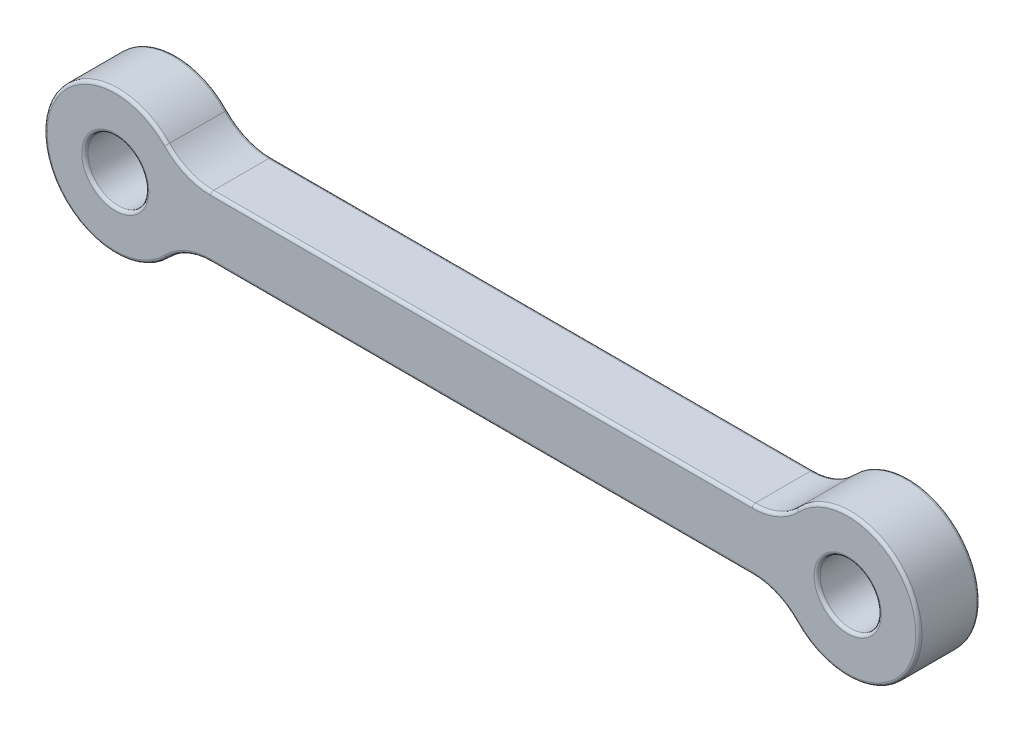
ISO-10303-21;
HEADER;
FILE_DESCRIPTION(('STEP AP214'),'2;1');
FILE_NAME('part.step','',(''),(''),'','','');
FILE_SCHEMA(('AUTOMOTIVE_DESIGN { 1 0 10303 214 1 1 1 1 }'));
ENDSEC;
DATA;
#1=APPLICATION_CONTEXT('core data for automotive mechanical design processes');
#2=APPLICATION_PROTOCOL_DEFINITION('international standard','automotive_design',2000,#1);
#3=PRODUCT_CONTEXT('',#1,'mechanical');
#4=PRODUCT('Part','Part','',(#3));
#5=PRODUCT_RELATED_PRODUCT_CATEGORY('part','',(#4));
#6=PRODUCT_DEFINITION_FORMATION('','',#4);
#7=PRODUCT_DEFINITION_CONTEXT('part definition',#1,'design');
#8=PRODUCT_DEFINITION('design','',#6,#7);
#9=PRODUCT_DEFINITION_SHAPE('','',#8);
#10=(LENGTH_UNIT() NAMED_UNIT(*) SI_UNIT(.MILLI.,.METRE.));
#11=(NAMED_UNIT(*) PLANE_ANGLE_UNIT() SI_UNIT($,.RADIAN.));
#12=(NAMED_UNIT(*) SI_UNIT($,.STERADIAN.) SOLID_ANGLE_UNIT());
#13=UNCERTAINTY_MEASURE_WITH_UNIT(LENGTH_MEASURE(1.E-05),#10,'distance_accuracy_value','');
#14=(GEOMETRIC_REPRESENTATION_CONTEXT(3) GLOBAL_UNCERTAINTY_ASSIGNED_CONTEXT((#13)) GLOBAL_UNIT_ASSIGNED_CONTEXT((#10,
#11,#12)) REPRESENTATION_CONTEXT('',''));
#15=CARTESIAN_POINT('',(0.,0.,0.));
#16=DIRECTION('',(0.,0.,1.));
#17=DIRECTION('',(1.,0.,0.));
#18=AXIS2_PLACEMENT_3D('',#15,#16,#17);
#19=CARTESIAN_POINT('',(0.,1.5,1.5));
#20=DIRECTION('',(0.,1.,0.));
#21=DIRECTION('',(-1.,0.,0.));
#22=AXIS2_PLACEMENT_3D('',#19,#20,#21);
#23=PLANE('',#22);
#24=DIRECTION('',(0.,0.,1.));
#25=VECTOR('',#24,1.);
#26=CARTESIAN_POINT('',(31.3095842401766,1.5,-1.5));
#27=LINE('',#26,#25);
#28=CARTESIAN_POINT('',(31.3095842401766,1.5,1.35));
#29=VERTEX_POINT('',#28);
#30=CARTESIAN_POINT('',(31.3095842401766,1.5,-1.35));
#31=VERTEX_POINT('',#30);
#32=EDGE_CURVE('E380',#29,#31,#27,.F.);
#33=ORIENTED_EDGE('',*,*,#32,.T.);
#34=DIRECTION('',(1.,0.,0.));
#35=VECTOR('',#34,1.);
#36=CARTESIAN_POINT('',(4.69041575982343,1.5,-1.35));
#37=LINE('',#36,#35);
#38=CARTESIAN_POINT('',(4.69041575982343,1.5,-1.35));
#39=VERTEX_POINT('',#38);
#40=EDGE_CURVE('E245',#31,#39,#37,.F.);
#41=ORIENTED_EDGE('',*,*,#40,.T.);
#42=DIRECTION('',(0.,0.,-1.));
#43=VECTOR('',#42,1.);
#44=CARTESIAN_POINT('',(4.69041575982343,1.5,1.5));
#45=LINE('',#44,#43);
#46=CARTESIAN_POINT('',(4.69041575982343,1.5,1.35));
#47=VERTEX_POINT('',#46);
#48=EDGE_CURVE('E376',#39,#47,#45,.F.);
#49=ORIENTED_EDGE('',*,*,#48,.T.);
#50=DIRECTION('',(1.,0.,0.));
#51=VECTOR('',#50,1.);
#52=CARTESIAN_POINT('',(0.,1.5,1.35));
#53=LINE('',#52,#51);
#54=EDGE_CURVE('E242',#47,#29,#53,.T.);
#55=ORIENTED_EDGE('',*,*,#54,.T.);
#56=EDGE_LOOP('',(#33,#41,#49,#55));
#57=FACE_BOUND('',#56,.T.);
#58=ADVANCED_FACE('F45',(#57),#23,.T.);
#59=CARTESIAN_POINT('',(0.,0.,1.5));
#60=DIRECTION('',(0.,0.,-1.));
#61=DIRECTION('',(-1.,0.,0.));
#62=AXIS2_PLACEMENT_3D('',#59,#60,#61);
#63=CYLINDRICAL_SURFACE('',#62,3.5);
#64=DIRECTION('',(0.,0.,-1.));
#65=VECTOR('',#64,1.);
#66=CARTESIAN_POINT('',(2.52560848605877,2.42307692307692,1.5));
#67=LINE('',#66,#65);
#68=CARTESIAN_POINT('',(2.52560848605877,2.42307692307692,1.35));
#69=VERTEX_POINT('',#68);
#70=CARTESIAN_POINT('',(2.52560848605877,2.42307692307692,-1.35));
#71=VERTEX_POINT('',#70);
#72=EDGE_CURVE('E363',#69,#71,#67,.T.);
#73=ORIENTED_EDGE('',*,*,#72,.T.);
#74=CARTESIAN_POINT('',(0.,0.,-1.35));
#75=DIRECTION('',(0.,0.,1.));
#76=DIRECTION('',(1.,0.,0.));
#77=AXIS2_PLACEMENT_3D('',#74,#75,#76);
#78=CIRCLE('',#77,3.5);
#79=CARTESIAN_POINT('',(2.52560848605877,-2.42307692307692,-1.35));
#80=VERTEX_POINT('',#79);
#81=EDGE_CURVE('E257',#71,#80,#78,.T.);
#82=ORIENTED_EDGE('',*,*,#81,.T.);
#83=DIRECTION('',(0.,0.,-1.));
#84=VECTOR('',#83,1.);
#85=CARTESIAN_POINT('',(2.52560848605877,-2.42307692307692,1.5));
#86=LINE('',#85,#84);
#87=CARTESIAN_POINT('',(2.52560848605877,-2.42307692307692,1.35));
#88=VERTEX_POINT('',#87);
#89=EDGE_CURVE('E354',#80,#88,#86,.F.);
#90=ORIENTED_EDGE('',*,*,#89,.T.);
#91=CARTESIAN_POINT('',(0.,0.,1.35));
#92=DIRECTION('',(0.,0.,1.));
#93=DIRECTION('',(1.,0.,0.));
#94=AXIS2_PLACEMENT_3D('',#91,#92,#93);
#95=CIRCLE('',#94,3.5);
#96=EDGE_CURVE('E254',#88,#69,#95,.F.);
#97=ORIENTED_EDGE('',*,*,#96,.T.);
#98=EDGE_LOOP('',(#73,#82,#90,#97));
#99=FACE_BOUND('',#98,.T.);
#100=ADVANCED_FACE('F359',(#99),#63,.T.);
#101=CARTESIAN_POINT('',(0.,-1.5,1.5));
#102=DIRECTION('',(0.,1.,0.));
#103=DIRECTION('',(-1.,0.,0.));
#104=AXIS2_PLACEMENT_3D('',#101,#102,#103);
#105=PLANE('',#104);
#106=DIRECTION('',(0.,0.,1.));
#107=VECTOR('',#106,1.);
#108=CARTESIAN_POINT('',(4.69041575982343,-1.5,-1.5));
#109=LINE('',#108,#107);
#110=CARTESIAN_POINT('',(4.69041575982343,-1.5,1.35));
#111=VERTEX_POINT('',#110);
#112=CARTESIAN_POINT('',(4.69041575982343,-1.5,-1.35));
#113=VERTEX_POINT('',#112);
#114=EDGE_CURVE('E356',#111,#113,#109,.F.);
#115=ORIENTED_EDGE('',*,*,#114,.T.);
#116=DIRECTION('',(1.,0.,0.));
#117=VECTOR('',#116,1.);
#118=CARTESIAN_POINT('',(0.,-1.5,-1.35));
#119=LINE('',#118,#117);
#120=CARTESIAN_POINT('',(31.3095842401766,-1.5,-1.35));
#121=VERTEX_POINT('',#120);
#122=EDGE_CURVE('E220',#113,#121,#119,.T.);
#123=ORIENTED_EDGE('',*,*,#122,.T.);
#124=DIRECTION('',(0.,0.,-1.));
#125=VECTOR('',#124,1.);
#126=CARTESIAN_POINT('',(31.3095842401766,-1.5,1.5));
#127=LINE('',#126,#125);
#128=CARTESIAN_POINT('',(31.3095842401766,-1.5,1.35));
#129=VERTEX_POINT('',#128);
#130=EDGE_CURVE('E309',#121,#129,#127,.F.);
#131=ORIENTED_EDGE('',*,*,#130,.T.);
#132=DIRECTION('',(1.,0.,0.));
#133=VECTOR('',#132,1.);
#134=CARTESIAN_POINT('',(4.69041575982343,-1.5,1.35));
#135=LINE('',#134,#133);
#136=EDGE_CURVE('E217',#129,#111,#135,.F.);
#137=ORIENTED_EDGE('',*,*,#136,.T.);
#138=EDGE_LOOP('',(#115,#123,#131,#137));
#139=FACE_BOUND('',#138,.T.);
#140=ADVANCED_FACE('F415',(#139),#105,.F.);
#141=CARTESIAN_POINT('',(0.,0.,1.5));
#142=DIRECTION('',(0.,0.,-1.));
#143=DIRECTION('',(-1.,0.,0.));
#144=AXIS2_PLACEMENT_3D('',#141,#142,#143);
#145=CYLINDRICAL_SURFACE('',#144,1.5);
#146=CARTESIAN_POINT('',(0.,0.,-1.35));
#147=DIRECTION('',(0.,0.,1.));
#148=DIRECTION('',(1.,0.,0.));
#149=AXIS2_PLACEMENT_3D('',#146,#147,#148);
#150=CIRCLE('',#149,1.5);
#151=CARTESIAN_POINT('',(1.5,0.,-1.35));
#152=VERTEX_POINT('',#151);
#153=EDGE_CURVE('E208',#152,#152,#150,.F.);
#154=ORIENTED_EDGE('',*,*,#153,.T.);
#155=EDGE_LOOP('',(#154));
#156=FACE_BOUND('',#155,.T.);
#157=CARTESIAN_POINT('',(0.,0.,1.35));
#158=DIRECTION('',(0.,0.,1.));
#159=DIRECTION('',(1.,0.,0.));
#160=AXIS2_PLACEMENT_3D('',#157,#158,#159);
#161=CIRCLE('',#160,1.5);
#162=CARTESIAN_POINT('',(1.5,0.,1.35));
#163=VERTEX_POINT('',#162);
#164=EDGE_CURVE('E204',#163,#163,#161,.T.);
#165=ORIENTED_EDGE('',*,*,#164,.T.);
#166=EDGE_LOOP('',(#165));
#167=FACE_BOUND('',#166,.T.);
#168=ADVANCED_FACE('F464',(#156,#167),#145,.F.);
#169=CARTESIAN_POINT('',(36.,0.,1.5));
#170=DIRECTION('',(0.,0.,-1.));
#171=DIRECTION('',(-1.,0.,0.));
#172=AXIS2_PLACEMENT_3D('',#169,#170,#171);
#173=CYLINDRICAL_SURFACE('',#172,3.5);
#174=DIRECTION('',(0.,0.,-1.));
#175=VECTOR('',#174,1.);
#176=CARTESIAN_POINT('',(33.4743915139412,-2.42307692307692,1.5));
#177=LINE('',#176,#175);
#178=CARTESIAN_POINT('',(33.4743915139412,-2.42307692307692,1.35));
#179=VERTEX_POINT('',#178);
#180=CARTESIAN_POINT('',(33.4743915139412,-2.42307692307692,-1.35));
#181=VERTEX_POINT('',#180);
#182=EDGE_CURVE('E368',#179,#181,#177,.T.);
#183=ORIENTED_EDGE('',*,*,#182,.T.);
#184=CARTESIAN_POINT('',(36.,0.,-1.35));
#185=DIRECTION('',(0.,0.,1.));
#186=DIRECTION('',(1.,0.,0.));
#187=AXIS2_PLACEMENT_3D('',#184,#185,#186);
#188=CIRCLE('',#187,3.5);
#189=CARTESIAN_POINT('',(33.4743915139412,2.42307692307692,-1.35));
#190=VERTEX_POINT('',#189);
#191=EDGE_CURVE('E232',#181,#190,#188,.T.);
#192=ORIENTED_EDGE('',*,*,#191,.T.);
#193=DIRECTION('',(0.,0.,-1.));
#194=VECTOR('',#193,1.);
#195=CARTESIAN_POINT('',(33.4743915139412,2.42307692307692,1.5));
#196=LINE('',#195,#194);
#197=CARTESIAN_POINT('',(33.4743915139412,2.42307692307692,1.35));
#198=VERTEX_POINT('',#197);
#199=EDGE_CURVE('E362',#190,#198,#196,.F.);
#200=ORIENTED_EDGE('',*,*,#199,.T.);
#201=CARTESIAN_POINT('',(36.,0.,1.35));
#202=DIRECTION('',(0.,0.,1.));
#203=DIRECTION('',(1.,0.,0.));
#204=AXIS2_PLACEMENT_3D('',#201,#202,#203);
#205=CIRCLE('',#204,3.5);
#206=EDGE_CURVE('E229',#198,#179,#205,.F.);
#207=ORIENTED_EDGE('',*,*,#206,.T.);
#208=EDGE_LOOP('',(#183,#192,#200,#207));
#209=FACE_BOUND('',#208,.T.);
#210=ADVANCED_FACE('F461',(#209),#173,.T.);
#211=CARTESIAN_POINT('',(36.,0.,1.5));
#212=DIRECTION('',(0.,0.,-1.));
#213=DIRECTION('',(-1.,0.,0.));
#214=AXIS2_PLACEMENT_3D('',#211,#212,#213);
#215=CYLINDRICAL_SURFACE('',#214,1.5);
#216=CARTESIAN_POINT('',(36.,0.,-1.35));
#217=DIRECTION('',(0.,0.,1.));
#218=DIRECTION('',(1.,0.,0.));
#219=AXIS2_PLACEMENT_3D('',#216,#217,#218);
#220=CIRCLE('',#219,1.5);
#221=CARTESIAN_POINT('',(37.5,0.,-1.35));
#222=VERTEX_POINT('',#221);
#223=EDGE_CURVE('E183',#222,#222,#220,.F.);
#224=ORIENTED_EDGE('',*,*,#223,.T.);
#225=EDGE_LOOP('',(#224));
#226=FACE_BOUND('',#225,.T.);
#227=CARTESIAN_POINT('',(36.,0.,1.35));
#228=DIRECTION('',(0.,0.,1.));
#229=DIRECTION('',(1.,0.,0.));
#230=AXIS2_PLACEMENT_3D('',#227,#228,#229);
#231=CIRCLE('',#230,1.5);
#232=CARTESIAN_POINT('',(37.5,0.,1.35));
#233=VERTEX_POINT('',#232);
#234=EDGE_CURVE('E384',#233,#233,#231,.T.);
#235=ORIENTED_EDGE('',*,*,#234,.T.);
#236=EDGE_LOOP('',(#235));
#237=FACE_BOUND('',#236,.T.);
#238=ADVANCED_FACE('F463',(#226,#237),#215,.F.);
#239=CARTESIAN_POINT('',(0.,0.,1.5));
#240=DIRECTION('',(0.,0.,1.));
#241=DIRECTION('',(1.,0.,0.));
#242=AXIS2_PLACEMENT_3D('',#239,#240,#241);
#243=PLANE('',#242);
#244=CARTESIAN_POINT('',(36.,0.,1.5));
#245=DIRECTION('',(0.,0.,1.));
#246=DIRECTION('',(1.,0.,0.));
#247=AXIS2_PLACEMENT_3D('',#244,#245,#246);
#248=CIRCLE('',#247,1.65);
#249=CARTESIAN_POINT('',(37.65,0.,1.5));
#250=VERTEX_POINT('',#249);
#251=EDGE_CURVE('E11',#250,#250,#248,.F.);
#252=ORIENTED_EDGE('',*,*,#251,.T.);
#253=EDGE_LOOP('',(#252));
#254=FACE_BOUND('',#253,.T.);
#255=CARTESIAN_POINT('',(0.,0.,1.5));
#256=DIRECTION('',(0.,0.,1.));
#257=DIRECTION('',(1.,0.,0.));
#258=AXIS2_PLACEMENT_3D('',#255,#256,#257);
#259=CIRCLE('',#258,1.65);
#260=CARTESIAN_POINT('',(1.65,0.,1.5));
#261=VERTEX_POINT('',#260);
#262=EDGE_CURVE('E55',#261,#261,#259,.F.);
#263=ORIENTED_EDGE('',*,*,#262,.T.);
#264=EDGE_LOOP('',(#263));
#265=FACE_BOUND('',#264,.T.);
#266=CARTESIAN_POINT('',(36.,0.,1.5));
#267=DIRECTION('',(0.,0.,1.));
#268=DIRECTION('',(1.,0.,0.));
#269=AXIS2_PLACEMENT_3D('',#266,#267,#268);
#270=CIRCLE('',#269,3.35);
#271=CARTESIAN_POINT('',(33.5826318776295,-2.31923076923077,1.5));
#272=VERTEX_POINT('',#271);
#273=CARTESIAN_POINT('',(33.5826318776295,2.31923076923077,1.5));
#274=VERTEX_POINT('',#273);
#275=EDGE_CURVE('E63',#272,#274,#270,.T.);
#276=ORIENTED_EDGE('',*,*,#275,.T.);
#277=CARTESIAN_POINT('',(31.3095842401766,4.5,1.5));
#278=DIRECTION('',(0.,0.,1.));
#279=DIRECTION('',(1.,0.,0.));
#280=AXIS2_PLACEMENT_3D('',#277,#278,#279);
#281=CIRCLE('',#280,3.15);
#282=CARTESIAN_POINT('',(31.3095842401766,1.35,1.5));
#283=VERTEX_POINT('',#282);
#284=EDGE_CURVE('E279',#274,#283,#281,.F.);
#285=ORIENTED_EDGE('',*,*,#284,.T.);
#286=DIRECTION('',(1.,0.,0.));
#287=VECTOR('',#286,1.);
#288=CARTESIAN_POINT('',(0.,1.35,1.5));
#289=LINE('',#288,#287);
#290=CARTESIAN_POINT('',(4.69041575982343,1.35,1.5));
#291=VERTEX_POINT('',#290);
#292=EDGE_CURVE('E260',#283,#291,#289,.F.);
#293=ORIENTED_EDGE('',*,*,#292,.T.);
#294=CARTESIAN_POINT('',(4.69041575982343,4.5,1.5));
#295=DIRECTION('',(0.,0.,1.));
#296=DIRECTION('',(1.,0.,0.));
#297=AXIS2_PLACEMENT_3D('',#294,#295,#296);
#298=CIRCLE('',#297,3.15);
#299=CARTESIAN_POINT('',(2.41736812237054,2.31923076923077,1.5));
#300=VERTEX_POINT('',#299);
#301=EDGE_CURVE('E263',#291,#300,#298,.F.);
#302=ORIENTED_EDGE('',*,*,#301,.T.);
#303=CARTESIAN_POINT('',(0.,0.,1.5));
#304=DIRECTION('',(0.,0.,1.));
#305=DIRECTION('',(1.,0.,0.));
#306=AXIS2_PLACEMENT_3D('',#303,#304,#305);
#307=CIRCLE('',#306,3.35);
#308=CARTESIAN_POINT('',(2.41736812237054,-2.31923076923077,1.5));
#309=VERTEX_POINT('',#308);
#310=EDGE_CURVE('E266',#300,#309,#307,.T.);
#311=ORIENTED_EDGE('',*,*,#310,.T.);
#312=CARTESIAN_POINT('',(4.69041575982343,-4.5,1.5));
#313=DIRECTION('',(0.,0.,1.));
#314=DIRECTION('',(1.,0.,0.));
#315=AXIS2_PLACEMENT_3D('',#312,#313,#314);
#316=CIRCLE('',#315,3.15);
#317=CARTESIAN_POINT('',(4.69041575982343,-1.35,1.5));
#318=VERTEX_POINT('',#317);
#319=EDGE_CURVE('E269',#309,#318,#316,.F.);
#320=ORIENTED_EDGE('',*,*,#319,.T.);
#321=DIRECTION('',(1.,0.,0.));
#322=VECTOR('',#321,1.);
#323=CARTESIAN_POINT('',(31.3095842401766,-1.35,1.5));
#324=LINE('',#323,#322);
#325=CARTESIAN_POINT('',(31.3095842401766,-1.35,1.5));
#326=VERTEX_POINT('',#325);
#327=EDGE_CURVE('E272',#318,#326,#324,.T.);
#328=ORIENTED_EDGE('',*,*,#327,.T.);
#329=CARTESIAN_POINT('',(31.3095842401766,-4.5,1.5));
#330=DIRECTION('',(0.,0.,1.));
#331=DIRECTION('',(1.,0.,0.));
#332=AXIS2_PLACEMENT_3D('',#329,#330,#331);
#333=CIRCLE('',#332,3.15);
#334=EDGE_CURVE('E68',#326,#272,#333,.F.);
#335=ORIENTED_EDGE('',*,*,#334,.T.);
#336=EDGE_LOOP('',(#276,#285,#293,#302,#311,#320,#328,#335));
#337=FACE_BOUND('',#336,.T.);
#338=ADVANCED_FACE('F434',(#254,#265,#337),#243,.T.);
#339=CARTESIAN_POINT('',(0.,0.,-1.5));
#340=DIRECTION('',(0.,0.,1.));
#341=DIRECTION('',(1.,0.,0.));
#342=AXIS2_PLACEMENT_3D('',#339,#340,#341);
#343=PLANE('',#342);
#344=CARTESIAN_POINT('',(36.,0.,-1.5));
#345=DIRECTION('',(0.,0.,1.));
#346=DIRECTION('',(1.,0.,0.));
#347=AXIS2_PLACEMENT_3D('',#344,#345,#346);
#348=CIRCLE('',#347,1.65);
#349=CARTESIAN_POINT('',(37.65,0.,-1.5));
#350=VERTEX_POINT('',#349);
#351=EDGE_CURVE('E195',#350,#350,#348,.T.);
#352=ORIENTED_EDGE('',*,*,#351,.T.);
#353=EDGE_LOOP('',(#352));
#354=FACE_BOUND('',#353,.T.);
#355=CARTESIAN_POINT('',(0.,0.,-1.5));
#356=DIRECTION('',(0.,0.,1.));
#357=DIRECTION('',(1.,0.,0.));
#358=AXIS2_PLACEMENT_3D('',#355,#356,#357);
#359=CIRCLE('',#358,1.65);
#360=CARTESIAN_POINT('',(1.65,0.,-1.5));
#361=VERTEX_POINT('',#360);
#362=EDGE_CURVE('E190',#361,#361,#359,.T.);
#363=ORIENTED_EDGE('',*,*,#362,.T.);
#364=EDGE_LOOP('',(#363));
#365=FACE_BOUND('',#364,.T.);
#366=DIRECTION('',(1.,0.,0.));
#367=VECTOR('',#366,1.);
#368=CARTESIAN_POINT('',(0.,-1.35,-1.5));
#369=LINE('',#368,#367);
#370=CARTESIAN_POINT('',(31.3095842401766,-1.35,-1.5));
#371=VERTEX_POINT('',#370);
#372=CARTESIAN_POINT('',(4.69041575982343,-1.35,-1.5));
#373=VERTEX_POINT('',#372);
#374=EDGE_CURVE('E187',#371,#373,#369,.F.);
#375=ORIENTED_EDGE('',*,*,#374,.T.);
#376=CARTESIAN_POINT('',(4.69041575982343,-4.5,-1.5));
#377=DIRECTION('',(0.,0.,1.));
#378=DIRECTION('',(1.,0.,0.));
#379=AXIS2_PLACEMENT_3D('',#376,#377,#378);
#380=CIRCLE('',#379,3.15);
#381=CARTESIAN_POINT('',(2.41736812237054,-2.31923076923077,-1.5));
#382=VERTEX_POINT('',#381);
#383=EDGE_CURVE('E166',#373,#382,#380,.T.);
#384=ORIENTED_EDGE('',*,*,#383,.T.);
#385=CARTESIAN_POINT('',(0.,0.,-1.5));
#386=DIRECTION('',(0.,0.,1.));
#387=DIRECTION('',(1.,0.,0.));
#388=AXIS2_PLACEMENT_3D('',#385,#386,#387);
#389=CIRCLE('',#388,3.35);
#390=CARTESIAN_POINT('',(2.41736812237054,2.31923076923077,-1.5));
#391=VERTEX_POINT('',#390);
#392=EDGE_CURVE('E175',#382,#391,#389,.F.);
#393=ORIENTED_EDGE('',*,*,#392,.T.);
#394=CARTESIAN_POINT('',(4.69041575982343,4.5,-1.5));
#395=DIRECTION('',(0.,0.,1.));
#396=DIRECTION('',(1.,0.,0.));
#397=AXIS2_PLACEMENT_3D('',#394,#395,#396);
#398=CIRCLE('',#397,3.15);
#399=CARTESIAN_POINT('',(4.69041575982343,1.35,-1.5));
#400=VERTEX_POINT('',#399);
#401=EDGE_CURVE('E182',#391,#400,#398,.T.);
#402=ORIENTED_EDGE('',*,*,#401,.T.);
#403=DIRECTION('',(1.,0.,0.));
#404=VECTOR('',#403,1.);
#405=CARTESIAN_POINT('',(31.3095842401766,1.35,-1.5));
#406=LINE('',#405,#404);
#407=CARTESIAN_POINT('',(31.3095842401766,1.35,-1.5));
#408=VERTEX_POINT('',#407);
#409=EDGE_CURVE('E393',#400,#408,#406,.T.);
#410=ORIENTED_EDGE('',*,*,#409,.T.);
#411=CARTESIAN_POINT('',(31.3095842401766,4.5,-1.5));
#412=DIRECTION('',(0.,0.,1.));
#413=DIRECTION('',(1.,0.,0.));
#414=AXIS2_PLACEMENT_3D('',#411,#412,#413);
#415=CIRCLE('',#414,3.15);
#416=CARTESIAN_POINT('',(33.5826318776295,2.31923076923077,-1.5));
#417=VERTEX_POINT('',#416);
#418=EDGE_CURVE('E396',#408,#417,#415,.T.);
#419=ORIENTED_EDGE('',*,*,#418,.T.);
#420=CARTESIAN_POINT('',(36.,0.,-1.5));
#421=DIRECTION('',(0.,0.,1.));
#422=DIRECTION('',(1.,0.,0.));
#423=AXIS2_PLACEMENT_3D('',#420,#421,#422);
#424=CIRCLE('',#423,3.35);
#425=CARTESIAN_POINT('',(33.5826318776295,-2.31923076923077,-1.5));
#426=VERTEX_POINT('',#425);
#427=EDGE_CURVE('E399',#417,#426,#424,.F.);
#428=ORIENTED_EDGE('',*,*,#427,.T.);
#429=CARTESIAN_POINT('',(31.3095842401766,-4.5,-1.5));
#430=DIRECTION('',(0.,0.,1.));
#431=DIRECTION('',(1.,0.,0.));
#432=AXIS2_PLACEMENT_3D('',#429,#430,#431);
#433=CIRCLE('',#432,3.15);
#434=EDGE_CURVE('E197',#426,#371,#433,.T.);
#435=ORIENTED_EDGE('',*,*,#434,.T.);
#436=EDGE_LOOP('',(#375,#384,#393,#402,#410,#419,#428,#435));
#437=FACE_BOUND('',#436,.T.);
#438=ADVANCED_FACE('F185',(#354,#365,#437),#343,.F.);
#439=CARTESIAN_POINT('',(4.69041575982343,-4.5,1.5));
#440=DIRECTION('',(0.,0.,-1.));
#441=DIRECTION('',(-1.,0.,0.));
#442=AXIS2_PLACEMENT_3D('',#439,#440,#441);
#443=CYLINDRICAL_SURFACE('',#442,3.);
#444=ORIENTED_EDGE('',*,*,#89,.F.);
#445=CARTESIAN_POINT('',(4.69041575982343,-4.5,-1.35));
#446=DIRECTION('',(0.,0.,1.));
#447=DIRECTION('',(1.,0.,0.));
#448=AXIS2_PLACEMENT_3D('',#445,#446,#447);
#449=CIRCLE('',#448,3.);
#450=EDGE_CURVE('E168',#80,#113,#449,.F.);
#451=ORIENTED_EDGE('',*,*,#450,.T.);
#452=ORIENTED_EDGE('',*,*,#114,.F.);
#453=CARTESIAN_POINT('',(4.69041575982343,-4.5,1.35));
#454=DIRECTION('',(0.,0.,1.));
#455=DIRECTION('',(1.,0.,0.));
#456=AXIS2_PLACEMENT_3D('',#453,#454,#455);
#457=CIRCLE('',#456,3.);
#458=EDGE_CURVE('E212',#111,#88,#457,.T.);
#459=ORIENTED_EDGE('',*,*,#458,.T.);
#460=EDGE_LOOP('',(#444,#451,#452,#459));
#461=FACE_BOUND('',#460,.T.);
#462=ADVANCED_FACE('F353',(#461),#443,.F.);
#463=CARTESIAN_POINT('',(31.3095842401766,-4.5,1.5));
#464=DIRECTION('',(0.,0.,-1.));
#465=DIRECTION('',(-1.,0.,0.));
#466=AXIS2_PLACEMENT_3D('',#463,#464,#465);
#467=CYLINDRICAL_SURFACE('',#466,3.);
#468=ORIENTED_EDGE('',*,*,#130,.F.);
#469=CARTESIAN_POINT('',(31.3095842401766,-4.5,-1.35));
#470=DIRECTION('',(0.,0.,1.));
#471=DIRECTION('',(1.,0.,0.));
#472=AXIS2_PLACEMENT_3D('',#469,#470,#471);
#473=CIRCLE('',#472,3.);
#474=EDGE_CURVE('E226',#121,#181,#473,.F.);
#475=ORIENTED_EDGE('',*,*,#474,.T.);
#476=ORIENTED_EDGE('',*,*,#182,.F.);
#477=CARTESIAN_POINT('',(31.3095842401766,-4.5,1.35));
#478=DIRECTION('',(0.,0.,1.));
#479=DIRECTION('',(1.,0.,0.));
#480=AXIS2_PLACEMENT_3D('',#477,#478,#479);
#481=CIRCLE('',#480,3.);
#482=EDGE_CURVE('E223',#179,#129,#481,.T.);
#483=ORIENTED_EDGE('',*,*,#482,.T.);
#484=EDGE_LOOP('',(#468,#475,#476,#483));
#485=FACE_BOUND('',#484,.T.);
#486=ADVANCED_FACE('F420',(#485),#467,.F.);
#487=CARTESIAN_POINT('',(31.3095842401766,4.5,1.5));
#488=DIRECTION('',(0.,0.,-1.));
#489=DIRECTION('',(-1.,0.,0.));
#490=AXIS2_PLACEMENT_3D('',#487,#488,#489);
#491=CYLINDRICAL_SURFACE('',#490,3.);
#492=ORIENTED_EDGE('',*,*,#199,.F.);
#493=CARTESIAN_POINT('',(31.3095842401766,4.5,-1.35));
#494=DIRECTION('',(0.,0.,1.));
#495=DIRECTION('',(1.,0.,0.));
#496=AXIS2_PLACEMENT_3D('',#493,#494,#495);
#497=CIRCLE('',#496,3.);
#498=EDGE_CURVE('E239',#190,#31,#497,.F.);
#499=ORIENTED_EDGE('',*,*,#498,.T.);
#500=ORIENTED_EDGE('',*,*,#32,.F.);
#501=CARTESIAN_POINT('',(31.3095842401766,4.5,1.35));
#502=DIRECTION('',(0.,0.,1.));
#503=DIRECTION('',(1.,0.,0.));
#504=AXIS2_PLACEMENT_3D('',#501,#502,#503);
#505=CIRCLE('',#504,3.);
#506=EDGE_CURVE('E235',#29,#198,#505,.T.);
#507=ORIENTED_EDGE('',*,*,#506,.T.);
#508=EDGE_LOOP('',(#492,#499,#500,#507));
#509=FACE_BOUND('',#508,.T.);
#510=ADVANCED_FACE('F450',(#509),#491,.F.);
#511=CARTESIAN_POINT('',(4.69041575982343,4.5,1.5));
#512=DIRECTION('',(0.,0.,-1.));
#513=DIRECTION('',(-1.,0.,0.));
#514=AXIS2_PLACEMENT_3D('',#511,#512,#513);
#515=CYLINDRICAL_SURFACE('',#514,3.);
#516=ORIENTED_EDGE('',*,*,#48,.F.);
#517=CARTESIAN_POINT('',(4.69041575982343,4.5,-1.35));
#518=DIRECTION('',(0.,0.,1.));
#519=DIRECTION('',(1.,0.,0.));
#520=AXIS2_PLACEMENT_3D('',#517,#518,#519);
#521=CIRCLE('',#520,3.);
#522=EDGE_CURVE('E251',#39,#71,#521,.F.);
#523=ORIENTED_EDGE('',*,*,#522,.T.);
#524=ORIENTED_EDGE('',*,*,#72,.F.);
#525=CARTESIAN_POINT('',(4.69041575982343,4.5,1.35));
#526=DIRECTION('',(0.,0.,1.));
#527=DIRECTION('',(1.,0.,0.));
#528=AXIS2_PLACEMENT_3D('',#525,#526,#527);
#529=CIRCLE('',#528,3.);
#530=EDGE_CURVE('E248',#69,#47,#529,.T.);
#531=ORIENTED_EDGE('',*,*,#530,.T.);
#532=EDGE_LOOP('',(#516,#523,#524,#531));
#533=FACE_BOUND('',#532,.T.);
#534=ADVANCED_FACE('F488',(#533),#515,.F.);
#535=CARTESIAN_POINT('',(36.,0.,-1.35));
#536=DIRECTION('',(0.,0.,1.));
#537=DIRECTION('',(1.,0.,0.));
#538=AXIS2_PLACEMENT_3D('',#535,#536,#537);
#539=TOROIDAL_SURFACE('',#538,1.65,0.15);
#540=ORIENTED_EDGE('',*,*,#351,.F.);
#541=EDGE_LOOP('',(#540));
#542=FACE_BOUND('',#541,.T.);
#543=ORIENTED_EDGE('',*,*,#223,.F.);
#544=EDGE_LOOP('',(#543));
#545=FACE_BOUND('',#544,.T.);
#546=ADVANCED_FACE('F491',(#542,#545),#539,.T.);
#547=CARTESIAN_POINT('',(0.,0.,-1.35));
#548=DIRECTION('',(0.,0.,1.));
#549=DIRECTION('',(1.,0.,0.));
#550=AXIS2_PLACEMENT_3D('',#547,#548,#549);
#551=TOROIDAL_SURFACE('',#550,1.65,0.15);
#552=ORIENTED_EDGE('',*,*,#153,.F.);
#553=EDGE_LOOP('',(#552));
#554=FACE_BOUND('',#553,.T.);
#555=ORIENTED_EDGE('',*,*,#362,.F.);
#556=EDGE_LOOP('',(#555));
#557=FACE_BOUND('',#556,.T.);
#558=ADVANCED_FACE('F495',(#554,#557),#551,.T.);
#559=CARTESIAN_POINT('',(31.3095842401766,4.5,-1.35));
#560=DIRECTION('',(0.,0.,1.));
#561=DIRECTION('',(1.,0.,0.));
#562=AXIS2_PLACEMENT_3D('',#559,#560,#561);
#563=TOROIDAL_SURFACE('',#562,3.15,0.15);
#564=CARTESIAN_POINT('',(31.3095842401766,1.35,-1.35));
#565=DIRECTION('',(-1.,0.,0.));
#566=DIRECTION('',(0.,0.,1.));
#567=AXIS2_PLACEMENT_3D('',#564,#565,#566);
#568=CIRCLE('',#567,0.15);
#569=EDGE_CURVE('E301',#31,#408,#568,.T.);
#570=ORIENTED_EDGE('',*,*,#569,.F.);
#571=ORIENTED_EDGE('',*,*,#498,.F.);
#572=CARTESIAN_POINT('',(33.5826318776295,2.31923076923077,-1.35));
#573=DIRECTION('',(0.692307692307681,0.721602424588231,0.));
#574=DIRECTION('',(-0.721602424588231,0.692307692307681,0.));
#575=AXIS2_PLACEMENT_3D('',#572,#573,#574);
#576=CIRCLE('',#575,0.15);
#577=EDGE_CURVE('E305',#417,#190,#576,.T.);
#578=ORIENTED_EDGE('',*,*,#577,.F.);
#579=ORIENTED_EDGE('',*,*,#418,.F.);
#580=EDGE_LOOP('',(#570,#571,#578,#579));
#581=FACE_BOUND('',#580,.T.);
#582=ADVANCED_FACE('F454',(#581),#563,.T.);
#583=CARTESIAN_POINT('',(36.,0.,-1.35));
#584=DIRECTION('',(0.,0.,1.));
#585=DIRECTION('',(1.,0.,0.));
#586=AXIS2_PLACEMENT_3D('',#583,#584,#585);
#587=TOROIDAL_SURFACE('',#586,3.35,0.15);
#588=ORIENTED_EDGE('',*,*,#577,.T.);
#589=ORIENTED_EDGE('',*,*,#191,.F.);
#590=CARTESIAN_POINT('',(33.5826318776295,-2.31923076923077,-1.35));
#591=DIRECTION('',(-0.692307692307679,0.721602424588232,0.));
#592=DIRECTION('',(-0.721602424588232,-0.692307692307679,0.));
#593=AXIS2_PLACEMENT_3D('',#590,#591,#592);
#594=CIRCLE('',#593,0.15);
#595=EDGE_CURVE('E297',#426,#181,#594,.T.);
#596=ORIENTED_EDGE('',*,*,#595,.F.);
#597=ORIENTED_EDGE('',*,*,#427,.F.);
#598=EDGE_LOOP('',(#588,#589,#596,#597));
#599=FACE_BOUND('',#598,.T.);
#600=ADVANCED_FACE('F459',(#599),#587,.T.);
#601=CARTESIAN_POINT('',(0.,1.35,-1.35));
#602=DIRECTION('',(-1.,0.,0.));
#603=DIRECTION('',(0.,-1.,0.));
#604=AXIS2_PLACEMENT_3D('',#601,#602,#603);
#605=CYLINDRICAL_SURFACE('',#604,0.15);
#606=ORIENTED_EDGE('',*,*,#569,.T.);
#607=ORIENTED_EDGE('',*,*,#409,.F.);
#608=CARTESIAN_POINT('',(4.69041575982343,1.35,-1.35));
#609=DIRECTION('',(-1.,0.,0.));
#610=DIRECTION('',(0.,0.,1.));
#611=AXIS2_PLACEMENT_3D('',#608,#609,#610);
#612=CIRCLE('',#611,0.15);
#613=EDGE_CURVE('E293',#39,#400,#612,.T.);
#614=ORIENTED_EDGE('',*,*,#613,.F.);
#615=ORIENTED_EDGE('',*,*,#40,.F.);
#616=EDGE_LOOP('',(#606,#607,#614,#615));
#617=FACE_BOUND('',#616,.T.);
#618=ADVANCED_FACE('F513',(#617),#605,.T.);
#619=CARTESIAN_POINT('',(31.3095842401766,-4.5,-1.35));
#620=DIRECTION('',(0.,0.,1.));
#621=DIRECTION('',(1.,0.,0.));
#622=AXIS2_PLACEMENT_3D('',#619,#620,#621);
#623=TOROIDAL_SURFACE('',#622,3.15,0.15);
#624=ORIENTED_EDGE('',*,*,#595,.T.);
#625=ORIENTED_EDGE('',*,*,#474,.F.);
#626=CARTESIAN_POINT('',(31.3095842401766,-1.35,-1.35));
#627=DIRECTION('',(-1.,0.,0.));
#628=DIRECTION('',(0.,0.,1.));
#629=AXIS2_PLACEMENT_3D('',#626,#627,#628);
#630=CIRCLE('',#629,0.15);
#631=EDGE_CURVE('E289',#371,#121,#630,.T.);
#632=ORIENTED_EDGE('',*,*,#631,.F.);
#633=ORIENTED_EDGE('',*,*,#434,.F.);
#634=EDGE_LOOP('',(#624,#625,#632,#633));
#635=FACE_BOUND('',#634,.T.);
#636=ADVANCED_FACE('F408',(#635),#623,.T.);
#637=CARTESIAN_POINT('',(4.69041575982343,4.5,-1.35));
#638=DIRECTION('',(0.,0.,1.));
#639=DIRECTION('',(1.,0.,0.));
#640=AXIS2_PLACEMENT_3D('',#637,#638,#639);
#641=TOROIDAL_SURFACE('',#640,3.15,0.15);
#642=ORIENTED_EDGE('',*,*,#613,.T.);
#643=ORIENTED_EDGE('',*,*,#401,.F.);
#644=CARTESIAN_POINT('',(2.41736812237054,2.31923076923077,-1.35));
#645=DIRECTION('',(-0.692307692307693,0.72160242458822,0.));
#646=DIRECTION('',(-0.72160242458822,-0.692307692307693,0.));
#647=AXIS2_PLACEMENT_3D('',#644,#645,#646);
#648=CIRCLE('',#647,0.15);
#649=EDGE_CURVE('E178',#71,#391,#648,.T.);
#650=ORIENTED_EDGE('',*,*,#649,.F.);
#651=ORIENTED_EDGE('',*,*,#522,.F.);
#652=EDGE_LOOP('',(#642,#643,#650,#651));
#653=FACE_BOUND('',#652,.T.);
#654=ADVANCED_FACE('F507',(#653),#641,.T.);
#655=CARTESIAN_POINT('',(0.,-1.35,-1.35));
#656=DIRECTION('',(1.,0.,0.));
#657=DIRECTION('',(0.,1.,0.));
#658=AXIS2_PLACEMENT_3D('',#655,#656,#657);
#659=CYLINDRICAL_SURFACE('',#658,0.15);
#660=ORIENTED_EDGE('',*,*,#631,.T.);
#661=ORIENTED_EDGE('',*,*,#122,.F.);
#662=CARTESIAN_POINT('',(4.69041575982343,-1.35,-1.35));
#663=DIRECTION('',(-1.,0.,0.));
#664=DIRECTION('',(0.,0.,1.));
#665=AXIS2_PLACEMENT_3D('',#662,#663,#664);
#666=CIRCLE('',#665,0.15);
#667=EDGE_CURVE('E172',#373,#113,#666,.T.);
#668=ORIENTED_EDGE('',*,*,#667,.F.);
#669=ORIENTED_EDGE('',*,*,#374,.F.);
#670=EDGE_LOOP('',(#660,#661,#668,#669));
#671=FACE_BOUND('',#670,.T.);
#672=ADVANCED_FACE('F411',(#671),#659,.T.);
#673=CARTESIAN_POINT('',(0.,0.,-1.35));
#674=DIRECTION('',(0.,0.,1.));
#675=DIRECTION('',(1.,0.,0.));
#676=AXIS2_PLACEMENT_3D('',#673,#674,#675);
#677=TOROIDAL_SURFACE('',#676,3.35,0.15);
#678=ORIENTED_EDGE('',*,*,#649,.T.);
#679=ORIENTED_EDGE('',*,*,#392,.F.);
#680=CARTESIAN_POINT('',(2.41736812237054,-2.31923076923077,-1.35));
#681=DIRECTION('',(0.692307692307693,0.72160242458822,0.));
#682=DIRECTION('',(-0.72160242458822,0.692307692307693,0.));
#683=AXIS2_PLACEMENT_3D('',#680,#681,#682);
#684=CIRCLE('',#683,0.15);
#685=EDGE_CURVE('E162',#80,#382,#684,.T.);
#686=ORIENTED_EDGE('',*,*,#685,.F.);
#687=ORIENTED_EDGE('',*,*,#81,.F.);
#688=EDGE_LOOP('',(#678,#679,#686,#687));
#689=FACE_BOUND('',#688,.T.);
#690=ADVANCED_FACE('F176',(#689),#677,.T.);
#691=CARTESIAN_POINT('',(4.69041575982343,-4.5,-1.35));
#692=DIRECTION('',(0.,0.,1.));
#693=DIRECTION('',(1.,0.,0.));
#694=AXIS2_PLACEMENT_3D('',#691,#692,#693);
#695=TOROIDAL_SURFACE('',#694,3.15,0.15);
#696=ORIENTED_EDGE('',*,*,#667,.T.);
#697=ORIENTED_EDGE('',*,*,#450,.F.);
#698=ORIENTED_EDGE('',*,*,#685,.T.);
#699=ORIENTED_EDGE('',*,*,#383,.F.);
#700=EDGE_LOOP('',(#696,#697,#698,#699));
#701=FACE_BOUND('',#700,.T.);
#702=ADVANCED_FACE('F164',(#701),#695,.T.);
#703=CARTESIAN_POINT('',(36.,0.,1.35));
#704=DIRECTION('',(0.,0.,1.));
#705=DIRECTION('',(1.,0.,0.));
#706=AXIS2_PLACEMENT_3D('',#703,#704,#705);
#707=TOROIDAL_SURFACE('',#706,1.65,0.15);
#708=ORIENTED_EDGE('',*,*,#234,.F.);
#709=EDGE_LOOP('',(#708));
#710=FACE_BOUND('',#709,.T.);
#711=ORIENTED_EDGE('',*,*,#251,.F.);
#712=EDGE_LOOP('',(#711));
#713=FACE_BOUND('',#712,.T.);
#714=ADVANCED_FACE('F502',(#710,#713),#707,.T.);
#715=CARTESIAN_POINT('',(0.,0.,1.35));
#716=DIRECTION('',(0.,0.,1.));
#717=DIRECTION('',(1.,0.,0.));
#718=AXIS2_PLACEMENT_3D('',#715,#716,#717);
#719=TOROIDAL_SURFACE('',#718,1.65,0.15);
#720=ORIENTED_EDGE('',*,*,#262,.F.);
#721=EDGE_LOOP('',(#720));
#722=FACE_BOUND('',#721,.T.);
#723=ORIENTED_EDGE('',*,*,#164,.F.);
#724=EDGE_LOOP('',(#723));
#725=FACE_BOUND('',#724,.T.);
#726=ADVANCED_FACE('F523',(#722,#725),#719,.T.);
#727=CARTESIAN_POINT('',(4.69041575982343,-4.5,1.35));
#728=DIRECTION('',(0.,0.,1.));
#729=DIRECTION('',(1.,0.,0.));
#730=AXIS2_PLACEMENT_3D('',#727,#728,#729);
#731=TOROIDAL_SURFACE('',#730,3.15,0.15);
#732=CARTESIAN_POINT('',(2.41736812237054,-2.31923076923077,1.35));
#733=DIRECTION('',(-0.692307692307693,-0.72160242458822,0.));
#734=DIRECTION('',(0.72160242458822,-0.692307692307693,0.));
#735=AXIS2_PLACEMENT_3D('',#732,#733,#734);
#736=CIRCLE('',#735,0.15);
#737=EDGE_CURVE('E331',#88,#309,#736,.T.);
#738=ORIENTED_EDGE('',*,*,#737,.F.);
#739=ORIENTED_EDGE('',*,*,#458,.F.);
#740=CARTESIAN_POINT('',(4.69041575982343,-1.35,1.35));
#741=DIRECTION('',(1.,0.,0.));
#742=DIRECTION('',(0.,0.,-1.));
#743=AXIS2_PLACEMENT_3D('',#740,#741,#742);
#744=CIRCLE('',#743,0.15);
#745=EDGE_CURVE('E49',#318,#111,#744,.T.);
#746=ORIENTED_EDGE('',*,*,#745,.F.);
#747=ORIENTED_EDGE('',*,*,#319,.F.);
#748=EDGE_LOOP('',(#738,#739,#746,#747));
#749=FACE_BOUND('',#748,.T.);
#750=ADVANCED_FACE('F47',(#749),#731,.T.);
#751=CARTESIAN_POINT('',(0.,-1.35,1.35));
#752=DIRECTION('',(-1.,0.,0.));
#753=DIRECTION('',(0.,-1.,0.));
#754=AXIS2_PLACEMENT_3D('',#751,#752,#753);
#755=CYLINDRICAL_SURFACE('',#754,0.15);
#756=ORIENTED_EDGE('',*,*,#745,.T.);
#757=ORIENTED_EDGE('',*,*,#136,.F.);
#758=CARTESIAN_POINT('',(31.3095842401766,-1.35,1.35));
#759=DIRECTION('',(1.,0.,0.));
#760=DIRECTION('',(0.,0.,-1.));
#761=AXIS2_PLACEMENT_3D('',#758,#759,#760);
#762=CIRCLE('',#761,0.15);
#763=EDGE_CURVE('E328',#326,#129,#762,.T.);
#764=ORIENTED_EDGE('',*,*,#763,.F.);
#765=ORIENTED_EDGE('',*,*,#327,.F.);
#766=EDGE_LOOP('',(#756,#757,#764,#765));
#767=FACE_BOUND('',#766,.T.);
#768=ADVANCED_FACE('F344',(#767),#755,.T.);
#769=CARTESIAN_POINT('',(0.,0.,1.35));
#770=DIRECTION('',(0.,0.,1.));
#771=DIRECTION('',(1.,0.,0.));
#772=AXIS2_PLACEMENT_3D('',#769,#770,#771);
#773=TOROIDAL_SURFACE('',#772,3.35,0.15);
#774=ORIENTED_EDGE('',*,*,#737,.T.);
#775=ORIENTED_EDGE('',*,*,#310,.F.);
#776=CARTESIAN_POINT('',(2.41736812237054,2.31923076923077,1.35));
#777=DIRECTION('',(0.692307692307693,-0.72160242458822,0.));
#778=DIRECTION('',(0.72160242458822,0.692307692307693,0.));
#779=AXIS2_PLACEMENT_3D('',#776,#777,#778);
#780=CIRCLE('',#779,0.15);
#781=EDGE_CURVE('E324',#69,#300,#780,.T.);
#782=ORIENTED_EDGE('',*,*,#781,.F.);
#783=ORIENTED_EDGE('',*,*,#96,.F.);
#784=EDGE_LOOP('',(#774,#775,#782,#783));
#785=FACE_BOUND('',#784,.T.);
#786=ADVANCED_FACE('F538',(#785),#773,.T.);
#787=CARTESIAN_POINT('',(31.3095842401766,-4.5,1.35));
#788=DIRECTION('',(0.,0.,1.));
#789=DIRECTION('',(1.,0.,0.));
#790=AXIS2_PLACEMENT_3D('',#787,#788,#789);
#791=TOROIDAL_SURFACE('',#790,3.15,0.15);
#792=ORIENTED_EDGE('',*,*,#763,.T.);
#793=ORIENTED_EDGE('',*,*,#482,.F.);
#794=CARTESIAN_POINT('',(33.5826318776295,-2.31923076923077,1.35));
#795=DIRECTION('',(0.692307692307681,-0.721602424588231,0.));
#796=DIRECTION('',(0.721602424588231,0.692307692307681,0.));
#797=AXIS2_PLACEMENT_3D('',#794,#795,#796);
#798=CIRCLE('',#797,0.15);
#799=EDGE_CURVE('E320',#272,#179,#798,.T.);
#800=ORIENTED_EDGE('',*,*,#799,.F.);
#801=ORIENTED_EDGE('',*,*,#334,.F.);
#802=EDGE_LOOP('',(#792,#793,#800,#801));
#803=FACE_BOUND('',#802,.T.);
#804=ADVANCED_FACE('F424',(#803),#791,.T.);
#805=CARTESIAN_POINT('',(4.69041575982343,4.5,1.35));
#806=DIRECTION('',(0.,0.,1.));
#807=DIRECTION('',(1.,0.,0.));
#808=AXIS2_PLACEMENT_3D('',#805,#806,#807);
#809=TOROIDAL_SURFACE('',#808,3.15,0.15);
#810=ORIENTED_EDGE('',*,*,#781,.T.);
#811=ORIENTED_EDGE('',*,*,#301,.F.);
#812=CARTESIAN_POINT('',(4.69041575982343,1.35,1.35));
#813=DIRECTION('',(1.,0.,0.));
#814=DIRECTION('',(0.,0.,-1.));
#815=AXIS2_PLACEMENT_3D('',#812,#813,#814);
#816=CIRCLE('',#815,0.15);
#817=EDGE_CURVE('E316',#47,#291,#816,.T.);
#818=ORIENTED_EDGE('',*,*,#817,.F.);
#819=ORIENTED_EDGE('',*,*,#530,.F.);
#820=EDGE_LOOP('',(#810,#811,#818,#819));
#821=FACE_BOUND('',#820,.T.);
#822=ADVANCED_FACE('F439',(#821),#809,.T.);
#823=CARTESIAN_POINT('',(36.,0.,1.35));
#824=DIRECTION('',(0.,0.,1.));
#825=DIRECTION('',(1.,0.,0.));
#826=AXIS2_PLACEMENT_3D('',#823,#824,#825);
#827=TOROIDAL_SURFACE('',#826,3.35,0.15);
#828=ORIENTED_EDGE('',*,*,#799,.T.);
#829=ORIENTED_EDGE('',*,*,#206,.F.);
#830=CARTESIAN_POINT('',(33.5826318776295,2.31923076923077,1.35));
#831=DIRECTION('',(-0.692307692307679,-0.721602424588232,0.));
#832=DIRECTION('',(0.721602424588232,-0.692307692307679,0.));
#833=AXIS2_PLACEMENT_3D('',#830,#831,#832);
#834=CIRCLE('',#833,0.15);
#835=EDGE_CURVE('E313',#274,#198,#834,.T.);
#836=ORIENTED_EDGE('',*,*,#835,.F.);
#837=ORIENTED_EDGE('',*,*,#275,.F.);
#838=EDGE_LOOP('',(#828,#829,#836,#837));
#839=FACE_BOUND('',#838,.T.);
#840=ADVANCED_FACE('F427',(#839),#827,.T.);
#841=CARTESIAN_POINT('',(0.,1.35,1.35));
#842=DIRECTION('',(1.,0.,0.));
#843=DIRECTION('',(0.,1.,0.));
#844=AXIS2_PLACEMENT_3D('',#841,#842,#843);
#845=CYLINDRICAL_SURFACE('',#844,0.15);
#846=ORIENTED_EDGE('',*,*,#817,.T.);
#847=ORIENTED_EDGE('',*,*,#292,.F.);
#848=CARTESIAN_POINT('',(31.3095842401766,1.35,1.35));
#849=DIRECTION('',(1.,0.,0.));
#850=DIRECTION('',(0.,0.,-1.));
#851=AXIS2_PLACEMENT_3D('',#848,#849,#850);
#852=CIRCLE('',#851,0.15);
#853=EDGE_CURVE('E310',#29,#283,#852,.T.);
#854=ORIENTED_EDGE('',*,*,#853,.F.);
#855=ORIENTED_EDGE('',*,*,#54,.F.);
#856=EDGE_LOOP('',(#846,#847,#854,#855));
#857=FACE_BOUND('',#856,.T.);
#858=ADVANCED_FACE('F443',(#857),#845,.T.);
#859=CARTESIAN_POINT('',(31.3095842401766,4.5,1.35));
#860=DIRECTION('',(0.,0.,1.));
#861=DIRECTION('',(1.,0.,0.));
#862=AXIS2_PLACEMENT_3D('',#859,#860,#861);
#863=TOROIDAL_SURFACE('',#862,3.15,0.15);
#864=ORIENTED_EDGE('',*,*,#835,.T.);
#865=ORIENTED_EDGE('',*,*,#506,.F.);
#866=ORIENTED_EDGE('',*,*,#853,.T.);
#867=ORIENTED_EDGE('',*,*,#284,.F.);
#868=EDGE_LOOP('',(#864,#865,#866,#867));
#869=FACE_BOUND('',#868,.T.);
#870=ADVANCED_FACE('F431',(#869),#863,.T.);
#871=CLOSED_SHELL('',(#58,#100,#140,#168,#210,#238,#338,#438,#462,#486,#510,#534,#546,#558,#582,
#600,#618,#636,#654,#672,#690,#702,#714,#726,#750,#768,#786,#804,#822,#840,#858,#870));
#872=MANIFOLD_SOLID_BREP('B2',#871);
#873=ADVANCED_BREP_SHAPE_REPRESENTATION('',(#18,#872),#14);
#874=SHAPE_DEFINITION_REPRESENTATION(#9,#873);
ENDSEC;
END-ISO-10303-21;
